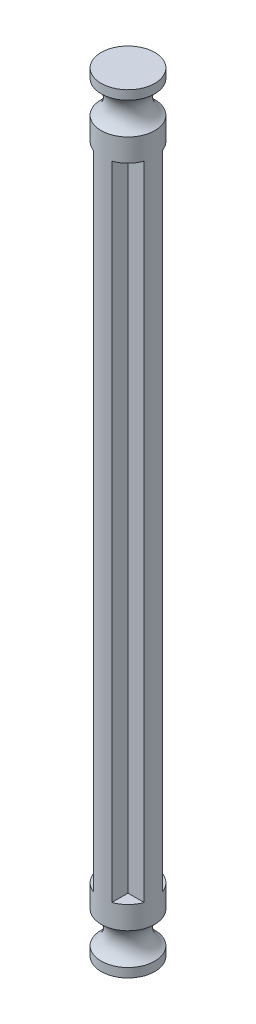
ISO-10303-21;
HEADER;
FILE_DESCRIPTION(('STEP AP214'),'2;1');
FILE_NAME('part.step','',(''),(''),'','','');
FILE_SCHEMA(('AUTOMOTIVE_DESIGN { 1 0 10303 214 1 1 1 1 }'));
ENDSEC;
DATA;
#1=APPLICATION_CONTEXT('core data for automotive mechanical design processes');
#2=APPLICATION_PROTOCOL_DEFINITION('international standard','automotive_design',2000,#1);
#3=PRODUCT_CONTEXT('',#1,'mechanical');
#4=PRODUCT('Part','Part','',(#3));
#5=PRODUCT_RELATED_PRODUCT_CATEGORY('part','',(#4));
#6=PRODUCT_DEFINITION_FORMATION('','',#4);
#7=PRODUCT_DEFINITION_CONTEXT('part definition',#1,'design');
#8=PRODUCT_DEFINITION('design','',#6,#7);
#9=PRODUCT_DEFINITION_SHAPE('','',#8);
#10=(LENGTH_UNIT() NAMED_UNIT(*) SI_UNIT(.MILLI.,.METRE.));
#11=(NAMED_UNIT(*) PLANE_ANGLE_UNIT() SI_UNIT($,.RADIAN.));
#12=(NAMED_UNIT(*) SI_UNIT($,.STERADIAN.) SOLID_ANGLE_UNIT());
#13=UNCERTAINTY_MEASURE_WITH_UNIT(LENGTH_MEASURE(1.E-05),#10,'distance_accuracy_value','');
#14=(GEOMETRIC_REPRESENTATION_CONTEXT(3) GLOBAL_UNCERTAINTY_ASSIGNED_CONTEXT((#13)) GLOBAL_UNIT_ASSIGNED_CONTEXT((#10,
#11,#12)) REPRESENTATION_CONTEXT('',''));
#15=CARTESIAN_POINT('',(0.,0.,0.));
#16=DIRECTION('',(0.,0.,1.));
#17=DIRECTION('',(1.,0.,0.));
#18=AXIS2_PLACEMENT_3D('',#15,#16,#17);
#19=CARTESIAN_POINT('',(1.,70.64,1.));
#20=DIRECTION('',(-1.,0.,0.));
#21=DIRECTION('',(0.,0.,1.));
#22=AXIS2_PLACEMENT_3D('',#19,#20,#21);
#23=PLANE('',#22);
#24=DIRECTION('',(0.,0.,-1.));
#25=VECTOR('',#24,1.);
#26=CARTESIAN_POINT('',(1.,0.,1.));
#27=LINE('',#26,#25);
#28=CARTESIAN_POINT('',(1.,0.,2.77533781727558));
#29=VERTEX_POINT('',#28);
#30=CARTESIAN_POINT('',(1.,0.,1.));
#31=VERTEX_POINT('',#30);
#32=EDGE_CURVE('E122',#29,#31,#27,.T.);
#33=ORIENTED_EDGE('',*,*,#32,.T.);
#34=DIRECTION('',(0.,-1.,0.));
#35=VECTOR('',#34,1.);
#36=CARTESIAN_POINT('',(1.,70.64,1.));
#37=LINE('',#36,#35);
#38=CARTESIAN_POINT('',(1.,70.64,1.));
#39=VERTEX_POINT('',#38);
#40=EDGE_CURVE('E11',#39,#31,#37,.T.);
#41=ORIENTED_EDGE('',*,*,#40,.F.);
#42=DIRECTION('',(0.,0.,-1.));
#43=VECTOR('',#42,1.);
#44=CARTESIAN_POINT('',(1.,70.64,1.));
#45=LINE('',#44,#43);
#46=CARTESIAN_POINT('',(0.999999999999999,70.64,2.77533781727558));
#47=VERTEX_POINT('',#46);
#48=EDGE_CURVE('E139',#47,#39,#45,.T.);
#49=ORIENTED_EDGE('',*,*,#48,.F.);
#50=DIRECTION('',(0.,-1.,0.));
#51=VECTOR('',#50,1.);
#52=CARTESIAN_POINT('',(0.999999999999999,70.64,2.77533781727558));
#53=LINE('',#52,#51);
#54=EDGE_CURVE('E52',#47,#29,#53,.T.);
#55=ORIENTED_EDGE('',*,*,#54,.T.);
#56=EDGE_LOOP('',(#33,#41,#49,#55));
#57=FACE_BOUND('',#56,.T.);
#58=ADVANCED_FACE('F37',(#57),#23,.F.);
#59=CARTESIAN_POINT('',(1.,70.64,1.));
#60=DIRECTION('',(0.,0.,-1.));
#61=DIRECTION('',(-1.,0.,0.));
#62=AXIS2_PLACEMENT_3D('',#59,#60,#61);
#63=PLANE('',#62);
#64=DIRECTION('',(1.,0.,0.));
#65=VECTOR('',#64,1.);
#66=CARTESIAN_POINT('',(1.,0.,1.));
#67=LINE('',#66,#65);
#68=CARTESIAN_POINT('',(2.77533781727558,0.,1.));
#69=VERTEX_POINT('',#68);
#70=EDGE_CURVE('E126',#31,#69,#67,.T.);
#71=ORIENTED_EDGE('',*,*,#70,.T.);
#72=DIRECTION('',(0.,-1.,0.));
#73=VECTOR('',#72,1.);
#74=CARTESIAN_POINT('',(2.77533781727558,70.64,1.));
#75=LINE('',#74,#73);
#76=CARTESIAN_POINT('',(2.77533781727558,70.64,1.));
#77=VERTEX_POINT('',#76);
#78=EDGE_CURVE('E45',#77,#69,#75,.T.);
#79=ORIENTED_EDGE('',*,*,#78,.F.);
#80=DIRECTION('',(1.,0.,0.));
#81=VECTOR('',#80,1.);
#82=CARTESIAN_POINT('',(1.,70.64,1.));
#83=LINE('',#82,#81);
#84=EDGE_CURVE('E213',#39,#77,#83,.T.);
#85=ORIENTED_EDGE('',*,*,#84,.F.);
#86=ORIENTED_EDGE('',*,*,#40,.T.);
#87=EDGE_LOOP('',(#71,#79,#85,#86));
#88=FACE_BOUND('',#87,.T.);
#89=ADVANCED_FACE('F277',(#88),#63,.F.);
#90=CARTESIAN_POINT('',(1.,70.64,-1.));
#91=DIRECTION('',(0.,0.,1.));
#92=DIRECTION('',(1.,0.,0.));
#93=AXIS2_PLACEMENT_3D('',#90,#91,#92);
#94=PLANE('',#93);
#95=DIRECTION('',(-1.,0.,0.));
#96=VECTOR('',#95,1.);
#97=CARTESIAN_POINT('',(1.,0.,-1.));
#98=LINE('',#97,#96);
#99=CARTESIAN_POINT('',(2.77533781727558,0.,-1.));
#100=VERTEX_POINT('',#99);
#101=CARTESIAN_POINT('',(1.,0.,-1.));
#102=VERTEX_POINT('',#101);
#103=EDGE_CURVE('E180',#100,#102,#98,.T.);
#104=ORIENTED_EDGE('',*,*,#103,.T.);
#105=DIRECTION('',(0.,-1.,0.));
#106=VECTOR('',#105,1.);
#107=CARTESIAN_POINT('',(1.,70.64,-1.));
#108=LINE('',#107,#106);
#109=CARTESIAN_POINT('',(1.,70.64,-1.));
#110=VERTEX_POINT('',#109);
#111=EDGE_CURVE('E171',#110,#102,#108,.T.);
#112=ORIENTED_EDGE('',*,*,#111,.F.);
#113=DIRECTION('',(-1.,0.,0.));
#114=VECTOR('',#113,1.);
#115=CARTESIAN_POINT('',(1.,70.64,-1.));
#116=LINE('',#115,#114);
#117=CARTESIAN_POINT('',(2.77533781727558,70.64,-1.));
#118=VERTEX_POINT('',#117);
#119=EDGE_CURVE('E182',#118,#110,#116,.T.);
#120=ORIENTED_EDGE('',*,*,#119,.F.);
#121=DIRECTION('',(0.,-1.,0.));
#122=VECTOR('',#121,1.);
#123=CARTESIAN_POINT('',(2.77533781727558,70.64,-1.));
#124=LINE('',#123,#122);
#125=EDGE_CURVE('E174',#118,#100,#124,.T.);
#126=ORIENTED_EDGE('',*,*,#125,.T.);
#127=EDGE_LOOP('',(#104,#112,#120,#126));
#128=FACE_BOUND('',#127,.T.);
#129=ADVANCED_FACE('F179',(#128),#94,.F.);
#130=CARTESIAN_POINT('',(1.,70.64,-1.));
#131=DIRECTION('',(-1.,0.,0.));
#132=DIRECTION('',(0.,0.,1.));
#133=AXIS2_PLACEMENT_3D('',#130,#131,#132);
#134=PLANE('',#133);
#135=DIRECTION('',(0.,0.,-1.));
#136=VECTOR('',#135,1.);
#137=CARTESIAN_POINT('',(1.,0.,-1.));
#138=LINE('',#137,#136);
#139=CARTESIAN_POINT('',(0.999999999999999,0.,-2.77533781727558));
#140=VERTEX_POINT('',#139);
#141=EDGE_CURVE('E230',#102,#140,#138,.T.);
#142=ORIENTED_EDGE('',*,*,#141,.T.);
#143=DIRECTION('',(0.,-1.,0.));
#144=VECTOR('',#143,1.);
#145=CARTESIAN_POINT('',(1.,70.64,-2.77533781727558));
#146=LINE('',#145,#144);
#147=CARTESIAN_POINT('',(1.,70.64,-2.77533781727558));
#148=VERTEX_POINT('',#147);
#149=EDGE_CURVE('E168',#148,#140,#146,.T.);
#150=ORIENTED_EDGE('',*,*,#149,.F.);
#151=DIRECTION('',(0.,0.,-1.));
#152=VECTOR('',#151,1.);
#153=CARTESIAN_POINT('',(1.,70.64,-1.));
#154=LINE('',#153,#152);
#155=EDGE_CURVE('E217',#110,#148,#154,.T.);
#156=ORIENTED_EDGE('',*,*,#155,.F.);
#157=ORIENTED_EDGE('',*,*,#111,.T.);
#158=EDGE_LOOP('',(#142,#150,#156,#157));
#159=FACE_BOUND('',#158,.T.);
#160=ADVANCED_FACE('F266',(#159),#134,.F.);
#161=CARTESIAN_POINT('',(-1.,70.64,-1.));
#162=DIRECTION('',(1.,0.,0.));
#163=DIRECTION('',(0.,0.,-1.));
#164=AXIS2_PLACEMENT_3D('',#161,#162,#163);
#165=PLANE('',#164);
#166=DIRECTION('',(0.,0.,1.));
#167=VECTOR('',#166,1.);
#168=CARTESIAN_POINT('',(-1.,0.,-1.));
#169=LINE('',#168,#167);
#170=CARTESIAN_POINT('',(-1.,0.,-2.77533781727558));
#171=VERTEX_POINT('',#170);
#172=CARTESIAN_POINT('',(-1.,0.,-1.));
#173=VERTEX_POINT('',#172);
#174=EDGE_CURVE('E232',#171,#173,#169,.T.);
#175=ORIENTED_EDGE('',*,*,#174,.T.);
#176=DIRECTION('',(0.,-1.,0.));
#177=VECTOR('',#176,1.);
#178=CARTESIAN_POINT('',(-1.,70.64,-1.));
#179=LINE('',#178,#177);
#180=CARTESIAN_POINT('',(-1.,70.64,-1.));
#181=VERTEX_POINT('',#180);
#182=EDGE_CURVE('E162',#181,#173,#179,.T.);
#183=ORIENTED_EDGE('',*,*,#182,.F.);
#184=DIRECTION('',(0.,0.,1.));
#185=VECTOR('',#184,1.);
#186=CARTESIAN_POINT('',(-1.,70.64,-1.));
#187=LINE('',#186,#185);
#188=CARTESIAN_POINT('',(-1.,70.64,-2.77533781727558));
#189=VERTEX_POINT('',#188);
#190=EDGE_CURVE('E220',#189,#181,#187,.T.);
#191=ORIENTED_EDGE('',*,*,#190,.F.);
#192=DIRECTION('',(0.,-1.,0.));
#193=VECTOR('',#192,1.);
#194=CARTESIAN_POINT('',(-1.,70.64,-2.77533781727558));
#195=LINE('',#194,#193);
#196=EDGE_CURVE('E165',#189,#171,#195,.T.);
#197=ORIENTED_EDGE('',*,*,#196,.T.);
#198=EDGE_LOOP('',(#175,#183,#191,#197));
#199=FACE_BOUND('',#198,.T.);
#200=ADVANCED_FACE('F264',(#199),#165,.F.);
#201=CARTESIAN_POINT('',(-1.,70.64,-1.));
#202=DIRECTION('',(0.,0.,1.));
#203=DIRECTION('',(1.,0.,0.));
#204=AXIS2_PLACEMENT_3D('',#201,#202,#203);
#205=PLANE('',#204);
#206=DIRECTION('',(-1.,0.,0.));
#207=VECTOR('',#206,1.);
#208=CARTESIAN_POINT('',(-1.,0.,-1.));
#209=LINE('',#208,#207);
#210=CARTESIAN_POINT('',(-2.77533781727558,0.,-1.));
#211=VERTEX_POINT('',#210);
#212=EDGE_CURVE('E235',#173,#211,#209,.T.);
#213=ORIENTED_EDGE('',*,*,#212,.T.);
#214=DIRECTION('',(0.,-1.,0.));
#215=VECTOR('',#214,1.);
#216=CARTESIAN_POINT('',(-2.77533781727558,70.64,-1.));
#217=LINE('',#216,#215);
#218=CARTESIAN_POINT('',(-2.77533781727558,70.64,-1.));
#219=VERTEX_POINT('',#218);
#220=EDGE_CURVE('E159',#219,#211,#217,.T.);
#221=ORIENTED_EDGE('',*,*,#220,.F.);
#222=DIRECTION('',(-1.,0.,0.));
#223=VECTOR('',#222,1.);
#224=CARTESIAN_POINT('',(-1.,70.64,-1.));
#225=LINE('',#224,#223);
#226=EDGE_CURVE('E223',#181,#219,#225,.T.);
#227=ORIENTED_EDGE('',*,*,#226,.F.);
#228=ORIENTED_EDGE('',*,*,#182,.T.);
#229=EDGE_LOOP('',(#213,#221,#227,#228));
#230=FACE_BOUND('',#229,.T.);
#231=ADVANCED_FACE('F260',(#230),#205,.F.);
#232=CARTESIAN_POINT('',(-1.,70.64,1.));
#233=DIRECTION('',(0.,0.,-1.));
#234=DIRECTION('',(-1.,0.,0.));
#235=AXIS2_PLACEMENT_3D('',#232,#233,#234);
#236=PLANE('',#235);
#237=DIRECTION('',(1.,0.,0.));
#238=VECTOR('',#237,1.);
#239=CARTESIAN_POINT('',(-1.,0.,1.));
#240=LINE('',#239,#238);
#241=CARTESIAN_POINT('',(-2.77533781727558,0.,1.));
#242=VERTEX_POINT('',#241);
#243=CARTESIAN_POINT('',(-1.,0.,1.));
#244=VERTEX_POINT('',#243);
#245=EDGE_CURVE('E237',#242,#244,#240,.T.);
#246=ORIENTED_EDGE('',*,*,#245,.T.);
#247=DIRECTION('',(0.,-1.,0.));
#248=VECTOR('',#247,1.);
#249=CARTESIAN_POINT('',(-1.,70.64,1.));
#250=LINE('',#249,#248);
#251=CARTESIAN_POINT('',(-1.,70.64,1.));
#252=VERTEX_POINT('',#251);
#253=EDGE_CURVE('E145',#252,#244,#250,.T.);
#254=ORIENTED_EDGE('',*,*,#253,.F.);
#255=DIRECTION('',(1.,0.,0.));
#256=VECTOR('',#255,1.);
#257=CARTESIAN_POINT('',(-1.,70.64,1.));
#258=LINE('',#257,#256);
#259=CARTESIAN_POINT('',(-2.77533781727558,70.64,0.999999999999999));
#260=VERTEX_POINT('',#259);
#261=EDGE_CURVE('E148',#260,#252,#258,.T.);
#262=ORIENTED_EDGE('',*,*,#261,.F.);
#263=DIRECTION('',(0.,-1.,0.));
#264=VECTOR('',#263,1.);
#265=CARTESIAN_POINT('',(-2.77533781727558,70.64,0.999999999999999));
#266=LINE('',#265,#264);
#267=EDGE_CURVE('E156',#260,#242,#266,.T.);
#268=ORIENTED_EDGE('',*,*,#267,.T.);
#269=EDGE_LOOP('',(#246,#254,#262,#268));
#270=FACE_BOUND('',#269,.T.);
#271=ADVANCED_FACE('F272',(#270),#236,.F.);
#272=CARTESIAN_POINT('',(-1.,70.64,1.));
#273=DIRECTION('',(1.,0.,0.));
#274=DIRECTION('',(0.,0.,-1.));
#275=AXIS2_PLACEMENT_3D('',#272,#273,#274);
#276=PLANE('',#275);
#277=DIRECTION('',(0.,0.,1.));
#278=VECTOR('',#277,1.);
#279=CARTESIAN_POINT('',(-1.,0.,1.));
#280=LINE('',#279,#278);
#281=CARTESIAN_POINT('',(-0.999999999999999,0.,2.77533781727558));
#282=VERTEX_POINT('',#281);
#283=EDGE_CURVE('E151',#244,#282,#280,.T.);
#284=ORIENTED_EDGE('',*,*,#283,.T.);
#285=DIRECTION('',(0.,-1.,0.));
#286=VECTOR('',#285,1.);
#287=CARTESIAN_POINT('',(-1.,70.64,2.77533781727558));
#288=LINE('',#287,#286);
#289=CARTESIAN_POINT('',(-0.999999999999999,70.64,2.7753378172756));
#290=VERTEX_POINT('',#289);
#291=EDGE_CURVE('E141',#290,#282,#288,.T.);
#292=ORIENTED_EDGE('',*,*,#291,.F.);
#293=DIRECTION('',(0.,0.,1.));
#294=VECTOR('',#293,1.);
#295=CARTESIAN_POINT('',(-1.,70.64,1.));
#296=LINE('',#295,#294);
#297=EDGE_CURVE('E142',#252,#290,#296,.T.);
#298=ORIENTED_EDGE('',*,*,#297,.F.);
#299=ORIENTED_EDGE('',*,*,#253,.T.);
#300=EDGE_LOOP('',(#284,#292,#298,#299));
#301=FACE_BOUND('',#300,.T.);
#302=ADVANCED_FACE('F242',(#301),#276,.F.);
#303=CARTESIAN_POINT('',(0.,70.64,0.));
#304=DIRECTION('',(0.,-1.,0.));
#305=DIRECTION('',(0.,0.,-1.));
#306=AXIS2_PLACEMENT_3D('',#303,#304,#305);
#307=CYLINDRICAL_SURFACE('',#306,2.95);
#308=CARTESIAN_POINT('',(0.,0.,0.));
#309=DIRECTION('',(0.,1.,0.));
#310=DIRECTION('',(0.,0.,1.));
#311=AXIS2_PLACEMENT_3D('',#308,#309,#310);
#312=CIRCLE('',#311,2.95);
#313=EDGE_CURVE('E124',#29,#69,#312,.T.);
#314=ORIENTED_EDGE('',*,*,#313,.F.);
#315=ORIENTED_EDGE('',*,*,#54,.F.);
#316=CARTESIAN_POINT('',(0.,70.64,0.));
#317=DIRECTION('',(0.,1.,0.));
#318=DIRECTION('',(0.,0.,1.));
#319=AXIS2_PLACEMENT_3D('',#316,#317,#318);
#320=CIRCLE('',#319,2.95000000000001);
#321=EDGE_CURVE('E129',#47,#77,#320,.T.);
#322=ORIENTED_EDGE('',*,*,#321,.T.);
#323=ORIENTED_EDGE('',*,*,#78,.T.);
#324=EDGE_LOOP('',(#314,#315,#322,#323));
#325=FACE_BOUND('',#324,.T.);
#326=EDGE_CURVE('E137',#242,#282,#312,.T.);
#327=ORIENTED_EDGE('',*,*,#326,.F.);
#328=ORIENTED_EDGE('',*,*,#267,.F.);
#329=EDGE_CURVE('E210',#260,#290,#320,.T.);
#330=ORIENTED_EDGE('',*,*,#329,.T.);
#331=ORIENTED_EDGE('',*,*,#291,.T.);
#332=EDGE_LOOP('',(#327,#328,#330,#331));
#333=FACE_BOUND('',#332,.T.);
#334=EDGE_CURVE('E191',#171,#211,#312,.T.);
#335=ORIENTED_EDGE('',*,*,#334,.F.);
#336=ORIENTED_EDGE('',*,*,#196,.F.);
#337=EDGE_CURVE('E251',#189,#219,#320,.T.);
#338=ORIENTED_EDGE('',*,*,#337,.T.);
#339=ORIENTED_EDGE('',*,*,#220,.T.);
#340=EDGE_LOOP('',(#335,#336,#338,#339));
#341=FACE_BOUND('',#340,.T.);
#342=ORIENTED_EDGE('',*,*,#149,.T.);
#343=EDGE_CURVE('E135',#100,#140,#312,.T.);
#344=ORIENTED_EDGE('',*,*,#343,.F.);
#345=ORIENTED_EDGE('',*,*,#125,.F.);
#346=EDGE_CURVE('E188',#118,#148,#320,.T.);
#347=ORIENTED_EDGE('',*,*,#346,.T.);
#348=EDGE_LOOP('',(#342,#344,#345,#347));
#349=FACE_BOUND('',#348,.T.);
#350=CARTESIAN_POINT('',(0.,73.14,0.));
#351=DIRECTION('',(0.,1.,0.));
#352=DIRECTION('',(0.,0.,1.));
#353=AXIS2_PLACEMENT_3D('',#350,#351,#352);
#354=CIRCLE('',#353,2.95000000000001);
#355=CARTESIAN_POINT('',(0.,73.14,2.95000000000002));
#356=VERTEX_POINT('',#355);
#357=EDGE_CURVE('E207',#356,#356,#354,.T.);
#358=ORIENTED_EDGE('',*,*,#357,.F.);
#359=EDGE_LOOP('',(#358));
#360=FACE_BOUND('',#359,.T.);
#361=CARTESIAN_POINT('',(0.,-2.5,0.));
#362=DIRECTION('',(0.,1.,0.));
#363=DIRECTION('',(0.,0.,1.));
#364=AXIS2_PLACEMENT_3D('',#361,#362,#363);
#365=CIRCLE('',#364,2.95);
#366=CARTESIAN_POINT('',(0.,-2.5,2.95));
#367=VERTEX_POINT('',#366);
#368=EDGE_CURVE('E134',#367,#367,#365,.T.);
#369=ORIENTED_EDGE('',*,*,#368,.T.);
#370=EDGE_LOOP('',(#369));
#371=FACE_BOUND('',#370,.T.);
#372=ADVANCED_FACE('F132',(#325,#333,#341,#349,#360,#371),#307,.T.);
#373=CARTESIAN_POINT('',(0.,70.64,0.));
#374=DIRECTION('',(0.,1.,0.));
#375=DIRECTION('',(0.,0.,1.));
#376=AXIS2_PLACEMENT_3D('',#373,#374,#375);
#377=PLANE('',#376);
#378=ORIENTED_EDGE('',*,*,#321,.F.);
#379=ORIENTED_EDGE('',*,*,#48,.T.);
#380=ORIENTED_EDGE('',*,*,#84,.T.);
#381=EDGE_LOOP('',(#378,#379,#380));
#382=FACE_BOUND('',#381,.T.);
#383=ADVANCED_FACE('F287',(#382),#377,.F.);
#384=ORIENTED_EDGE('',*,*,#346,.F.);
#385=ORIENTED_EDGE('',*,*,#119,.T.);
#386=ORIENTED_EDGE('',*,*,#155,.T.);
#387=EDGE_LOOP('',(#384,#385,#386));
#388=FACE_BOUND('',#387,.T.);
#389=ADVANCED_FACE('F289',(#388),#377,.F.);
#390=ORIENTED_EDGE('',*,*,#337,.F.);
#391=ORIENTED_EDGE('',*,*,#190,.T.);
#392=ORIENTED_EDGE('',*,*,#226,.T.);
#393=EDGE_LOOP('',(#390,#391,#392));
#394=FACE_BOUND('',#393,.T.);
#395=ADVANCED_FACE('F257',(#394),#377,.F.);
#396=ORIENTED_EDGE('',*,*,#329,.F.);
#397=ORIENTED_EDGE('',*,*,#261,.T.);
#398=ORIENTED_EDGE('',*,*,#297,.T.);
#399=EDGE_LOOP('',(#396,#397,#398));
#400=FACE_BOUND('',#399,.T.);
#401=ADVANCED_FACE('F291',(#400),#377,.F.);
#402=CARTESIAN_POINT('',(0.,74.89,0.));
#403=DIRECTION('',(0.,1.,0.));
#404=DIRECTION('',(0.,0.,1.));
#405=AXIS2_PLACEMENT_3D('',#402,#403,#404);
#406=TOROIDAL_SURFACE('',#405,3.91824583655186,2.);
#407=CARTESIAN_POINT('',(0.,76.64,0.));
#408=DIRECTION('',(0.,1.,0.));
#409=DIRECTION('',(0.,0.,1.));
#410=AXIS2_PLACEMENT_3D('',#407,#408,#409);
#411=CIRCLE('',#410,2.95000000000001);
#412=CARTESIAN_POINT('',(0.,76.64,2.95000000000002));
#413=VERTEX_POINT('',#412);
#414=EDGE_CURVE('E204',#413,#413,#411,.T.);
#415=ORIENTED_EDGE('',*,*,#414,.F.);
#416=EDGE_LOOP('',(#415));
#417=FACE_BOUND('',#416,.T.);
#418=ORIENTED_EDGE('',*,*,#357,.T.);
#419=EDGE_LOOP('',(#418));
#420=FACE_BOUND('',#419,.T.);
#421=ADVANCED_FACE('F300',(#417,#420),#406,.F.);
#422=CARTESIAN_POINT('',(0.,0.,0.));
#423=DIRECTION('',(0.,1.,0.));
#424=DIRECTION('',(0.,0.,1.));
#425=AXIS2_PLACEMENT_3D('',#422,#423,#424);
#426=CYLINDRICAL_SURFACE('',#425,2.95000000000001);
#427=CARTESIAN_POINT('',(0.,77.64,0.));
#428=DIRECTION('',(0.,1.,0.));
#429=DIRECTION('',(0.,0.,1.));
#430=AXIS2_PLACEMENT_3D('',#427,#428,#429);
#431=CIRCLE('',#430,2.95000000000001);
#432=CARTESIAN_POINT('',(0.,77.64,2.95000000000002));
#433=VERTEX_POINT('',#432);
#434=EDGE_CURVE('E201',#433,#433,#431,.T.);
#435=ORIENTED_EDGE('',*,*,#434,.F.);
#436=EDGE_LOOP('',(#435));
#437=FACE_BOUND('',#436,.T.);
#438=ORIENTED_EDGE('',*,*,#414,.T.);
#439=EDGE_LOOP('',(#438));
#440=FACE_BOUND('',#439,.T.);
#441=ADVANCED_FACE('F305',(#437,#440),#426,.T.);
#442=CARTESIAN_POINT('',(0.,77.64,0.));
#443=DIRECTION('',(0.,-1.,0.));
#444=DIRECTION('',(0.,0.,-1.));
#445=AXIS2_PLACEMENT_3D('',#442,#443,#444);
#446=PLANE('',#445);
#447=ORIENTED_EDGE('',*,*,#434,.T.);
#448=EDGE_LOOP('',(#447));
#449=FACE_BOUND('',#448,.T.);
#450=ADVANCED_FACE('F405',(#449),#446,.F.);
#451=CARTESIAN_POINT('',(0.,0.,0.));
#452=DIRECTION('',(0.,-1.,0.));
#453=DIRECTION('',(0.,0.,-1.));
#454=AXIS2_PLACEMENT_3D('',#451,#452,#453);
#455=PLANE('',#454);
#456=ORIENTED_EDGE('',*,*,#283,.F.);
#457=ORIENTED_EDGE('',*,*,#245,.F.);
#458=ORIENTED_EDGE('',*,*,#326,.T.);
#459=EDGE_LOOP('',(#456,#457,#458));
#460=FACE_BOUND('',#459,.T.);
#461=ADVANCED_FACE('F414',(#460),#455,.F.);
#462=ORIENTED_EDGE('',*,*,#212,.F.);
#463=ORIENTED_EDGE('',*,*,#174,.F.);
#464=ORIENTED_EDGE('',*,*,#334,.T.);
#465=EDGE_LOOP('',(#462,#463,#464));
#466=FACE_BOUND('',#465,.T.);
#467=ADVANCED_FACE('F262',(#466),#455,.F.);
#468=ORIENTED_EDGE('',*,*,#141,.F.);
#469=ORIENTED_EDGE('',*,*,#103,.F.);
#470=ORIENTED_EDGE('',*,*,#343,.T.);
#471=EDGE_LOOP('',(#468,#469,#470));
#472=FACE_BOUND('',#471,.T.);
#473=ADVANCED_FACE('F430',(#472),#455,.F.);
#474=ORIENTED_EDGE('',*,*,#32,.F.);
#475=ORIENTED_EDGE('',*,*,#313,.T.);
#476=ORIENTED_EDGE('',*,*,#70,.F.);
#477=EDGE_LOOP('',(#474,#475,#476));
#478=FACE_BOUND('',#477,.T.);
#479=ADVANCED_FACE('F123',(#478),#455,.F.);
#480=CARTESIAN_POINT('',(0.,-7.,0.));
#481=DIRECTION('',(0.,1.,0.));
#482=DIRECTION('',(0.,0.,1.));
#483=AXIS2_PLACEMENT_3D('',#480,#481,#482);
#484=PLANE('',#483);
#485=CARTESIAN_POINT('',(0.,-7.,0.));
#486=DIRECTION('',(0.,1.,0.));
#487=DIRECTION('',(0.,0.,1.));
#488=AXIS2_PLACEMENT_3D('',#485,#486,#487);
#489=CIRCLE('',#488,2.95);
#490=CARTESIAN_POINT('',(0.,-7.,2.95));
#491=VERTEX_POINT('',#490);
#492=EDGE_CURVE('E198',#491,#491,#489,.T.);
#493=ORIENTED_EDGE('',*,*,#492,.F.);
#494=EDGE_LOOP('',(#493));
#495=FACE_BOUND('',#494,.T.);
#496=ADVANCED_FACE('F443',(#495),#484,.F.);
#497=CARTESIAN_POINT('',(0.,0.,0.));
#498=DIRECTION('',(0.,1.,0.));
#499=DIRECTION('',(0.,0.,1.));
#500=AXIS2_PLACEMENT_3D('',#497,#498,#499);
#501=CYLINDRICAL_SURFACE('',#500,2.95);
#502=CARTESIAN_POINT('',(0.,-6.,0.));
#503=DIRECTION('',(0.,1.,0.));
#504=DIRECTION('',(0.,0.,1.));
#505=AXIS2_PLACEMENT_3D('',#502,#503,#504);
#506=CIRCLE('',#505,2.95);
#507=CARTESIAN_POINT('',(0.,-6.,2.95));
#508=VERTEX_POINT('',#507);
#509=EDGE_CURVE('E195',#508,#508,#506,.T.);
#510=ORIENTED_EDGE('',*,*,#509,.F.);
#511=EDGE_LOOP('',(#510));
#512=FACE_BOUND('',#511,.T.);
#513=ORIENTED_EDGE('',*,*,#492,.T.);
#514=EDGE_LOOP('',(#513));
#515=FACE_BOUND('',#514,.T.);
#516=ADVANCED_FACE('F450',(#512,#515),#501,.T.);
#517=CARTESIAN_POINT('',(0.,-4.25,0.));
#518=DIRECTION('',(0.,1.,0.));
#519=DIRECTION('',(0.,0.,1.));
#520=AXIS2_PLACEMENT_3D('',#517,#518,#519);
#521=TOROIDAL_SURFACE('',#520,3.91824583655185,2.);
#522=ORIENTED_EDGE('',*,*,#368,.F.);
#523=EDGE_LOOP('',(#522));
#524=FACE_BOUND('',#523,.T.);
#525=ORIENTED_EDGE('',*,*,#509,.T.);
#526=EDGE_LOOP('',(#525));
#527=FACE_BOUND('',#526,.T.);
#528=ADVANCED_FACE('F459',(#524,#527),#521,.F.);
#529=CLOSED_SHELL('',(#58,#89,#129,#160,#200,#231,#271,#302,#372,#383,#389,#395,#401,#421,#441,
#450,#461,#467,#473,#479,#496,#516,#528));
#530=MANIFOLD_SOLID_BREP('B2',#529);
#531=ADVANCED_BREP_SHAPE_REPRESENTATION('',(#18,#530),#14);
#532=SHAPE_DEFINITION_REPRESENTATION(#9,#531);
ENDSEC;
END-ISO-10303-21;
